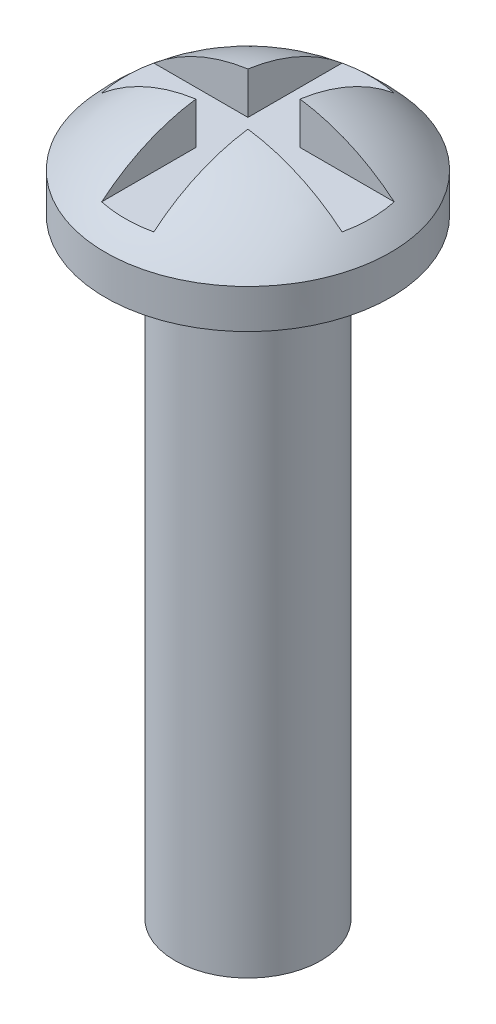
ISO-10303-21;
HEADER;
FILE_DESCRIPTION(('STEP AP214'),'2;1');
FILE_NAME('part.step','',(''),(''),'','','');
FILE_SCHEMA(('AUTOMOTIVE_DESIGN { 1 0 10303 214 1 1 1 1 }'));
ENDSEC;
DATA;
#1=APPLICATION_CONTEXT('core data for automotive mechanical design processes');
#2=APPLICATION_PROTOCOL_DEFINITION('international standard','automotive_design',2000,#1);
#3=PRODUCT_CONTEXT('',#1,'mechanical');
#4=PRODUCT('Part','Part','',(#3));
#5=PRODUCT_RELATED_PRODUCT_CATEGORY('part','',(#4));
#6=PRODUCT_DEFINITION_FORMATION('','',#4);
#7=PRODUCT_DEFINITION_CONTEXT('part definition',#1,'design');
#8=PRODUCT_DEFINITION('design','',#6,#7);
#9=PRODUCT_DEFINITION_SHAPE('','',#8);
#10=(LENGTH_UNIT() NAMED_UNIT(*) SI_UNIT(.MILLI.,.METRE.));
#11=(NAMED_UNIT(*) PLANE_ANGLE_UNIT() SI_UNIT($,.RADIAN.));
#12=(NAMED_UNIT(*) SI_UNIT($,.STERADIAN.) SOLID_ANGLE_UNIT());
#13=UNCERTAINTY_MEASURE_WITH_UNIT(LENGTH_MEASURE(1.E-05),#10,'distance_accuracy_value','');
#14=(GEOMETRIC_REPRESENTATION_CONTEXT(3) GLOBAL_UNCERTAINTY_ASSIGNED_CONTEXT((#13)) GLOBAL_UNIT_ASSIGNED_CONTEXT((#10,
#11,#12)) REPRESENTATION_CONTEXT('',''));
#15=CARTESIAN_POINT('',(0.,0.,0.));
#16=DIRECTION('',(0.,0.,1.));
#17=DIRECTION('',(1.,0.,0.));
#18=AXIS2_PLACEMENT_3D('',#15,#16,#17);
#19=CARTESIAN_POINT('',(-0.508,1.143,3.33756));
#20=DIRECTION('',(0.,-1.,0.));
#21=DIRECTION('',(0.,0.,-1.));
#22=AXIS2_PLACEMENT_3D('',#19,#20,#21);
#23=PLANE('',#22);
#24=DIRECTION('',(1.,0.,0.));
#25=VECTOR('',#24,1.);
#26=CARTESIAN_POINT('',(3.33756,1.143,0.508));
#27=LINE('',#26,#25);
#28=CARTESIAN_POINT('',(0.508,1.143,0.508));
#29=VERTEX_POINT('',#28);
#30=CARTESIAN_POINT('',(2.34426657677833,1.143,0.508));
#31=VERTEX_POINT('',#30);
#32=EDGE_CURVE('E150',#29,#31,#27,.T.);
#33=ORIENTED_EDGE('',*,*,#32,.T.);
#34=CARTESIAN_POINT('',(0.,1.143,0.));
#35=DIRECTION('',(0.,-1.,0.));
#36=DIRECTION('',(0.,0.,-1.));
#37=AXIS2_PLACEMENT_3D('',#34,#35,#36);
#38=CIRCLE('',#37,2.398676673293);
#39=CARTESIAN_POINT('',(2.34426657677833,1.143,-0.508));
#40=VERTEX_POINT('',#39);
#41=EDGE_CURVE('E115',#40,#31,#38,.T.);
#42=ORIENTED_EDGE('',*,*,#41,.F.);
#43=DIRECTION('',(-1.,0.,0.));
#44=VECTOR('',#43,1.);
#45=CARTESIAN_POINT('',(3.33756,1.143,-0.508));
#46=LINE('',#45,#44);
#47=CARTESIAN_POINT('',(0.508,1.143,-0.508));
#48=VERTEX_POINT('',#47);
#49=EDGE_CURVE('E117',#40,#48,#46,.T.);
#50=ORIENTED_EDGE('',*,*,#49,.T.);
#51=DIRECTION('',(0.,0.,-1.));
#52=VECTOR('',#51,1.);
#53=CARTESIAN_POINT('',(0.508,1.143,3.33756));
#54=LINE('',#53,#52);
#55=CARTESIAN_POINT('',(0.508,1.143,-2.34426657677833));
#56=VERTEX_POINT('',#55);
#57=EDGE_CURVE('E114',#48,#56,#54,.T.);
#58=ORIENTED_EDGE('',*,*,#57,.T.);
#59=CARTESIAN_POINT('',(0.,1.143,0.));
#60=DIRECTION('',(0.,-1.,0.));
#61=DIRECTION('',(0.,0.,-1.));
#62=AXIS2_PLACEMENT_3D('',#59,#60,#61);
#63=CIRCLE('',#62,2.398676673293);
#64=CARTESIAN_POINT('',(-0.507999999999997,1.143,-2.34426657677833));
#65=VERTEX_POINT('',#64);
#66=EDGE_CURVE('E118',#65,#56,#63,.T.);
#67=ORIENTED_EDGE('',*,*,#66,.F.);
#68=DIRECTION('',(0.,0.,1.));
#69=VECTOR('',#68,1.);
#70=CARTESIAN_POINT('',(-0.508,1.143,3.33756));
#71=LINE('',#70,#69);
#72=CARTESIAN_POINT('',(-0.508,1.143,-0.508));
#73=VERTEX_POINT('',#72);
#74=EDGE_CURVE('E126',#65,#73,#71,.T.);
#75=ORIENTED_EDGE('',*,*,#74,.T.);
#76=DIRECTION('',(-1.,0.,0.));
#77=VECTOR('',#76,1.);
#78=CARTESIAN_POINT('',(3.33756,1.143,-0.508));
#79=LINE('',#78,#77);
#80=CARTESIAN_POINT('',(-2.34426657677833,1.143,-0.508));
#81=VERTEX_POINT('',#80);
#82=EDGE_CURVE('E124',#73,#81,#79,.T.);
#83=ORIENTED_EDGE('',*,*,#82,.T.);
#84=CARTESIAN_POINT('',(0.,1.143,0.));
#85=DIRECTION('',(0.,-1.,0.));
#86=DIRECTION('',(0.,0.,-1.));
#87=AXIS2_PLACEMENT_3D('',#84,#85,#86);
#88=CIRCLE('',#87,2.398676673293);
#89=CARTESIAN_POINT('',(-2.34426657677833,1.143,0.508));
#90=VERTEX_POINT('',#89);
#91=EDGE_CURVE('E89',#90,#81,#88,.T.);
#92=ORIENTED_EDGE('',*,*,#91,.F.);
#93=DIRECTION('',(1.,0.,0.));
#94=VECTOR('',#93,1.);
#95=CARTESIAN_POINT('',(3.33756,1.143,0.508));
#96=LINE('',#95,#94);
#97=CARTESIAN_POINT('',(-0.508,1.143,0.508));
#98=VERTEX_POINT('',#97);
#99=EDGE_CURVE('E94',#90,#98,#96,.T.);
#100=ORIENTED_EDGE('',*,*,#99,.T.);
#101=DIRECTION('',(0.,0.,1.));
#102=VECTOR('',#101,1.);
#103=CARTESIAN_POINT('',(-0.508,1.143,3.33756));
#104=LINE('',#103,#102);
#105=CARTESIAN_POINT('',(-0.508,1.143,2.34426657677833));
#106=VERTEX_POINT('',#105);
#107=EDGE_CURVE('E91',#98,#106,#104,.T.);
#108=ORIENTED_EDGE('',*,*,#107,.T.);
#109=CARTESIAN_POINT('',(0.,1.143,0.));
#110=DIRECTION('',(0.,-1.,0.));
#111=DIRECTION('',(0.,0.,-1.));
#112=AXIS2_PLACEMENT_3D('',#109,#110,#111);
#113=CIRCLE('',#112,2.398676673293);
#114=CARTESIAN_POINT('',(0.507999999999997,1.143,2.34426657677833));
#115=VERTEX_POINT('',#114);
#116=EDGE_CURVE('E20',#115,#106,#113,.T.);
#117=ORIENTED_EDGE('',*,*,#116,.F.);
#118=DIRECTION('',(0.,0.,-1.));
#119=VECTOR('',#118,1.);
#120=CARTESIAN_POINT('',(0.508,1.143,3.33756));
#121=LINE('',#120,#119);
#122=EDGE_CURVE('E154',#115,#29,#121,.T.);
#123=ORIENTED_EDGE('',*,*,#122,.T.);
#124=EDGE_LOOP('',(#33,#42,#50,#58,#67,#75,#83,#92,#100,#108,#117,#123));
#125=FACE_BOUND('',#124,.T.);
#126=ADVANCED_FACE('F16',(#125),#23,.F.);
#127=CARTESIAN_POINT('',(3.33756,1.143,-0.508));
#128=DIRECTION('',(0.,0.,-1.));
#129=DIRECTION('',(-1.,0.,0.));
#130=AXIS2_PLACEMENT_3D('',#127,#128,#129);
#131=PLANE('',#130);
#132=CARTESIAN_POINT('',(0.,-1.6485235,-0.508));
#133=DIRECTION('',(0.,0.,-1.));
#134=DIRECTION('',(-1.,0.,0.));
#135=AXIS2_PLACEMENT_3D('',#132,#133,#134);
#136=CIRCLE('',#135,3.64529686501007);
#137=CARTESIAN_POINT('',(0.508,1.96120297634862,-0.508));
#138=VERTEX_POINT('',#137);
#139=EDGE_CURVE('E111',#138,#40,#136,.T.);
#140=ORIENTED_EDGE('',*,*,#139,.F.);
#141=DIRECTION('',(0.,1.,0.));
#142=VECTOR('',#141,1.);
#143=CARTESIAN_POINT('',(0.508,1.143,-0.508));
#144=LINE('',#143,#142);
#145=EDGE_CURVE('E177',#138,#48,#144,.F.);
#146=ORIENTED_EDGE('',*,*,#145,.T.);
#147=ORIENTED_EDGE('',*,*,#49,.F.);
#148=EDGE_LOOP('',(#140,#146,#147));
#149=FACE_BOUND('',#148,.T.);
#150=ADVANCED_FACE('F287',(#149),#131,.F.);
#151=CARTESIAN_POINT('',(3.33756,3.18147932635552,0.508));
#152=DIRECTION('',(0.,0.,1.));
#153=DIRECTION('',(1.,0.,0.));
#154=AXIS2_PLACEMENT_3D('',#151,#152,#153);
#155=PLANE('',#154);
#156=CARTESIAN_POINT('',(0.,-1.6485235,0.508));
#157=DIRECTION('',(0.,0.,1.));
#158=DIRECTION('',(1.,0.,0.));
#159=AXIS2_PLACEMENT_3D('',#156,#157,#158);
#160=CIRCLE('',#159,3.64529686501007);
#161=CARTESIAN_POINT('',(0.507999999999997,1.96120297634862,0.508));
#162=VERTEX_POINT('',#161);
#163=EDGE_CURVE('E106',#31,#162,#160,.T.);
#164=ORIENTED_EDGE('',*,*,#163,.F.);
#165=ORIENTED_EDGE('',*,*,#32,.F.);
#166=DIRECTION('',(0.,1.,0.));
#167=VECTOR('',#166,1.);
#168=CARTESIAN_POINT('',(0.508,1.143,0.508));
#169=LINE('',#168,#167);
#170=EDGE_CURVE('E98',#29,#162,#169,.T.);
#171=ORIENTED_EDGE('',*,*,#170,.T.);
#172=EDGE_LOOP('',(#164,#165,#171));
#173=FACE_BOUND('',#172,.T.);
#174=ADVANCED_FACE('F277',(#173),#155,.F.);
#175=CARTESIAN_POINT('',(0.508,1.143,3.33756));
#176=DIRECTION('',(1.,0.,0.));
#177=DIRECTION('',(0.,0.,-1.));
#178=AXIS2_PLACEMENT_3D('',#175,#176,#177);
#179=PLANE('',#178);
#180=ORIENTED_EDGE('',*,*,#170,.F.);
#181=ORIENTED_EDGE('',*,*,#122,.F.);
#182=CARTESIAN_POINT('',(0.507999999999994,-1.6485235,0.));
#183=DIRECTION('',(-1.,0.,0.));
#184=DIRECTION('',(0.,0.,1.));
#185=AXIS2_PLACEMENT_3D('',#182,#183,#184);
#186=CIRCLE('',#185,3.64529686501007);
#187=EDGE_CURVE('E88',#162,#115,#186,.F.);
#188=ORIENTED_EDGE('',*,*,#187,.F.);
#189=EDGE_LOOP('',(#180,#181,#188));
#190=FACE_BOUND('',#189,.T.);
#191=ADVANCED_FACE('F268',(#190),#179,.F.);
#192=CARTESIAN_POINT('',(-0.508,4.318,3.33756));
#193=DIRECTION('',(-1.,0.,0.));
#194=DIRECTION('',(0.,0.,1.));
#195=AXIS2_PLACEMENT_3D('',#192,#193,#194);
#196=PLANE('',#195);
#197=DIRECTION('',(0.,1.,0.));
#198=VECTOR('',#197,1.);
#199=CARTESIAN_POINT('',(-0.508,3.18147932635552,0.508));
#200=LINE('',#199,#198);
#201=CARTESIAN_POINT('',(-0.508,1.96120297634862,0.508));
#202=VERTEX_POINT('',#201);
#203=EDGE_CURVE('E97',#98,#202,#200,.T.);
#204=ORIENTED_EDGE('',*,*,#203,.T.);
#205=CARTESIAN_POINT('',(-0.508,-1.6485235,0.));
#206=DIRECTION('',(-1.,0.,0.));
#207=DIRECTION('',(0.,0.,1.));
#208=AXIS2_PLACEMENT_3D('',#205,#206,#207);
#209=CIRCLE('',#208,3.64529686501007);
#210=EDGE_CURVE('E85',#106,#202,#209,.T.);
#211=ORIENTED_EDGE('',*,*,#210,.F.);
#212=ORIENTED_EDGE('',*,*,#107,.F.);
#213=EDGE_LOOP('',(#204,#211,#212));
#214=FACE_BOUND('',#213,.T.);
#215=ADVANCED_FACE('F100',(#214),#196,.F.);
#216=CARTESIAN_POINT('',(3.33756,3.18147932635552,0.508));
#217=DIRECTION('',(0.,0.,1.));
#218=DIRECTION('',(1.,0.,0.));
#219=AXIS2_PLACEMENT_3D('',#216,#217,#218);
#220=PLANE('',#219);
#221=CARTESIAN_POINT('',(0.,-1.6485235,0.508));
#222=DIRECTION('',(0.,0.,1.));
#223=DIRECTION('',(1.,0.,0.));
#224=AXIS2_PLACEMENT_3D('',#221,#222,#223);
#225=CIRCLE('',#224,3.64529686501007);
#226=EDGE_CURVE('E102',#202,#90,#225,.T.);
#227=ORIENTED_EDGE('',*,*,#226,.F.);
#228=ORIENTED_EDGE('',*,*,#203,.F.);
#229=ORIENTED_EDGE('',*,*,#99,.F.);
#230=EDGE_LOOP('',(#227,#228,#229));
#231=FACE_BOUND('',#230,.T.);
#232=ADVANCED_FACE('F201',(#231),#220,.F.);
#233=CARTESIAN_POINT('',(3.33756,1.143,-0.508));
#234=DIRECTION('',(0.,0.,-1.));
#235=DIRECTION('',(-1.,0.,0.));
#236=AXIS2_PLACEMENT_3D('',#233,#234,#235);
#237=PLANE('',#236);
#238=CARTESIAN_POINT('',(0.,-1.6485235,-0.508));
#239=DIRECTION('',(0.,0.,-1.));
#240=DIRECTION('',(-1.,0.,0.));
#241=AXIS2_PLACEMENT_3D('',#238,#239,#240);
#242=CIRCLE('',#241,3.64529686501007);
#243=CARTESIAN_POINT('',(-0.507999999999997,1.96120297634862,-0.508));
#244=VERTEX_POINT('',#243);
#245=EDGE_CURVE('E104',#81,#244,#242,.T.);
#246=ORIENTED_EDGE('',*,*,#245,.F.);
#247=ORIENTED_EDGE('',*,*,#82,.F.);
#248=DIRECTION('',(0.,1.,0.));
#249=VECTOR('',#248,1.);
#250=CARTESIAN_POINT('',(-0.508,4.318,-0.508));
#251=LINE('',#250,#249);
#252=EDGE_CURVE('E131',#73,#244,#251,.T.);
#253=ORIENTED_EDGE('',*,*,#252,.T.);
#254=EDGE_LOOP('',(#246,#247,#253));
#255=FACE_BOUND('',#254,.T.);
#256=ADVANCED_FACE('F130',(#255),#237,.F.);
#257=CARTESIAN_POINT('',(-0.508,4.318,3.33756));
#258=DIRECTION('',(-1.,0.,0.));
#259=DIRECTION('',(0.,0.,1.));
#260=AXIS2_PLACEMENT_3D('',#257,#258,#259);
#261=PLANE('',#260);
#262=ORIENTED_EDGE('',*,*,#252,.F.);
#263=ORIENTED_EDGE('',*,*,#74,.F.);
#264=CARTESIAN_POINT('',(-0.507999999999994,-1.6485235,0.));
#265=DIRECTION('',(-1.,0.,0.));
#266=DIRECTION('',(0.,0.,1.));
#267=AXIS2_PLACEMENT_3D('',#264,#265,#266);
#268=CIRCLE('',#267,3.64529686501007);
#269=EDGE_CURVE('E133',#244,#65,#268,.T.);
#270=ORIENTED_EDGE('',*,*,#269,.F.);
#271=EDGE_LOOP('',(#262,#263,#270));
#272=FACE_BOUND('',#271,.T.);
#273=ADVANCED_FACE('F192',(#272),#261,.F.);
#274=CARTESIAN_POINT('',(0.508,1.143,3.33756));
#275=DIRECTION('',(1.,0.,0.));
#276=DIRECTION('',(0.,0.,-1.));
#277=AXIS2_PLACEMENT_3D('',#274,#275,#276);
#278=PLANE('',#277);
#279=ORIENTED_EDGE('',*,*,#145,.F.);
#280=CARTESIAN_POINT('',(0.508,-1.6485235,0.));
#281=DIRECTION('',(-1.,0.,0.));
#282=DIRECTION('',(0.,0.,1.));
#283=AXIS2_PLACEMENT_3D('',#280,#281,#282);
#284=CIRCLE('',#283,3.64529686501007);
#285=EDGE_CURVE('E134',#56,#138,#284,.F.);
#286=ORIENTED_EDGE('',*,*,#285,.F.);
#287=ORIENTED_EDGE('',*,*,#57,.F.);
#288=EDGE_LOOP('',(#279,#286,#287));
#289=FACE_BOUND('',#288,.T.);
#290=ADVANCED_FACE('F190',(#289),#278,.F.);
#291=CARTESIAN_POINT('',(0.,-1.6485235,0.));
#292=DIRECTION('',(-1.,0.,0.));
#293=DIRECTION('',(0.,0.64713728840334,0.762373484558567));
#294=AXIS2_PLACEMENT_3D('',#291,#292,#293);
#295=SPHERICAL_SURFACE('',#294,3.6805235);
#296=ORIENTED_EDGE('',*,*,#66,.T.);
#297=ORIENTED_EDGE('',*,*,#285,.T.);
#298=ORIENTED_EDGE('',*,*,#139,.T.);
#299=ORIENTED_EDGE('',*,*,#41,.T.);
#300=ORIENTED_EDGE('',*,*,#163,.T.);
#301=ORIENTED_EDGE('',*,*,#187,.T.);
#302=ORIENTED_EDGE('',*,*,#116,.T.);
#303=ORIENTED_EDGE('',*,*,#210,.T.);
#304=ORIENTED_EDGE('',*,*,#226,.T.);
#305=ORIENTED_EDGE('',*,*,#91,.T.);
#306=ORIENTED_EDGE('',*,*,#245,.T.);
#307=ORIENTED_EDGE('',*,*,#269,.T.);
#308=EDGE_LOOP('',(#296,#297,#298,#299,#300,#301,#302,#303,#304,#305,#306,#307));
#309=FACE_BOUND('',#308,.T.);
#310=CARTESIAN_POINT('',(0.,0.762,0.));
#311=DIRECTION('',(0.,-1.,0.));
#312=DIRECTION('',(0.,0.,-1.));
#313=AXIS2_PLACEMENT_3D('',#310,#311,#312);
#314=CIRCLE('',#313,2.7813);
#315=CARTESIAN_POINT('',(0.,0.762,-2.7813));
#316=VERTEX_POINT('',#315);
#317=EDGE_CURVE('E139',#316,#316,#314,.T.);
#318=ORIENTED_EDGE('',*,*,#317,.F.);
#319=EDGE_LOOP('',(#318));
#320=FACE_BOUND('',#319,.T.);
#321=ADVANCED_FACE('F18',(#309,#320),#295,.T.);
#322=CARTESIAN_POINT('',(0.,2.7686,0.));
#323=DIRECTION('',(0.,-1.,0.));
#324=DIRECTION('',(0.,0.,-1.));
#325=AXIS2_PLACEMENT_3D('',#322,#323,#324);
#326=CYLINDRICAL_SURFACE('',#325,2.7813);
#327=ORIENTED_EDGE('',*,*,#317,.T.);
#328=EDGE_LOOP('',(#327));
#329=FACE_BOUND('',#328,.T.);
#330=CARTESIAN_POINT('',(0.,0.,0.));
#331=DIRECTION('',(0.,-1.,0.));
#332=DIRECTION('',(0.,0.,-1.));
#333=AXIS2_PLACEMENT_3D('',#330,#331,#332);
#334=CIRCLE('',#333,2.7813);
#335=CARTESIAN_POINT('',(0.,0.,-2.7813));
#336=VERTEX_POINT('',#335);
#337=EDGE_CURVE('E142',#336,#336,#334,.T.);
#338=ORIENTED_EDGE('',*,*,#337,.F.);
#339=EDGE_LOOP('',(#338));
#340=FACE_BOUND('',#339,.T.);
#341=ADVANCED_FACE('F217',(#329,#340),#326,.T.);
#342=CARTESIAN_POINT('',(0.,0.,0.));
#343=DIRECTION('',(0.,-1.,0.));
#344=DIRECTION('',(0.,0.,-1.));
#345=AXIS2_PLACEMENT_3D('',#342,#343,#344);
#346=PLANE('',#345);
#347=ORIENTED_EDGE('',*,*,#337,.T.);
#348=EDGE_LOOP('',(#347));
#349=FACE_BOUND('',#348,.T.);
#350=CARTESIAN_POINT('',(0.,0.,0.));
#351=DIRECTION('',(0.,-1.,0.));
#352=DIRECTION('',(0.,0.,-1.));
#353=AXIS2_PLACEMENT_3D('',#350,#351,#352);
#354=CIRCLE('',#353,1.4224);
#355=CARTESIAN_POINT('',(0.,0.,-1.4224));
#356=VERTEX_POINT('',#355);
#357=EDGE_CURVE('E26',#356,#356,#354,.T.);
#358=ORIENTED_EDGE('',*,*,#357,.F.);
#359=EDGE_LOOP('',(#358));
#360=FACE_BOUND('',#359,.T.);
#361=ADVANCED_FACE('F211',(#349,#360),#346,.T.);
#362=CARTESIAN_POINT('',(0.,-11.8787769771416,0.));
#363=DIRECTION('',(0.,1.,0.));
#364=DIRECTION('',(0.,0.,1.));
#365=AXIS2_PLACEMENT_3D('',#362,#363,#364);
#366=CONICAL_SURFACE('',#365,1.42240000008087,1.04719755106333);
#367=CARTESIAN_POINT('',(0.,-12.7000000003363,0.));
#368=VERTEX_POINT('',#367);
#369=VERTEX_LOOP('',#368);
#370=FACE_BOUND('',#369,.T.);
#371=CARTESIAN_POINT('',(0.,-11.8787769771052,0.));
#372=DIRECTION('',(0.,-1.,0.));
#373=DIRECTION('',(0.,0.,-1.));
#374=AXIS2_PLACEMENT_3D('',#371,#372,#373);
#375=CIRCLE('',#374,1.4224);
#376=CARTESIAN_POINT('',(0.,-11.8787769771052,-1.4224));
#377=VERTEX_POINT('',#376);
#378=EDGE_CURVE('E11',#377,#377,#375,.F.);
#379=ORIENTED_EDGE('',*,*,#378,.F.);
#380=EDGE_LOOP('',(#379));
#381=FACE_BOUND('',#380,.T.);
#382=ADVANCED_FACE('F205',(#370,#381),#366,.T.);
#383=CARTESIAN_POINT('',(0.,2.7686,0.));
#384=DIRECTION('',(0.,-1.,0.));
#385=DIRECTION('',(0.,0.,-1.));
#386=AXIS2_PLACEMENT_3D('',#383,#384,#385);
#387=CYLINDRICAL_SURFACE('',#386,1.4224);
#388=ORIENTED_EDGE('',*,*,#378,.T.);
#389=EDGE_LOOP('',(#388));
#390=FACE_BOUND('',#389,.T.);
#391=ORIENTED_EDGE('',*,*,#357,.T.);
#392=EDGE_LOOP('',(#391));
#393=FACE_BOUND('',#392,.T.);
#394=ADVANCED_FACE('F203',(#390,#393),#387,.T.);
#395=CLOSED_SHELL('',(#126,#150,#174,#191,#215,#232,#256,#273,#290,#321,#341,#361,#382,#394));
#396=MANIFOLD_SOLID_BREP('B1',#395);
#397=ADVANCED_BREP_SHAPE_REPRESENTATION('',(#18,#396),#14);
#398=SHAPE_DEFINITION_REPRESENTATION(#9,#397);
ENDSEC;
END-ISO-10303-21;
